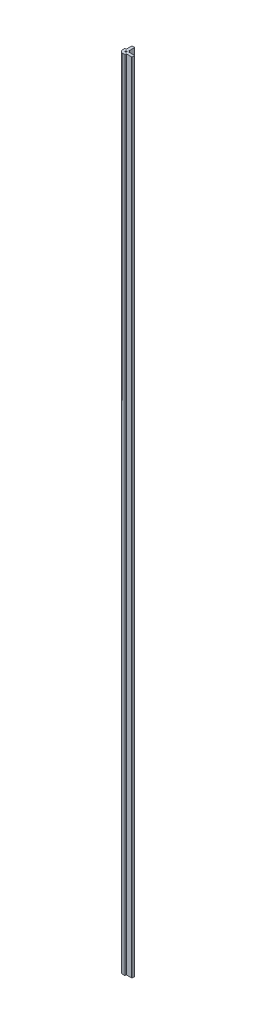
ISO-10303-21;
HEADER;
FILE_DESCRIPTION(('STEP AP214'),'2;1');
FILE_NAME('part.step','',(''),(''),'','','');
FILE_SCHEMA(('AUTOMOTIVE_DESIGN { 1 0 10303 214 1 1 1 1 }'));
ENDSEC;
DATA;
#1=APPLICATION_CONTEXT('core data for automotive mechanical design processes');
#2=APPLICATION_PROTOCOL_DEFINITION('international standard','automotive_design',2000,#1);
#3=PRODUCT_CONTEXT('',#1,'mechanical');
#4=PRODUCT('Part','Part','',(#3));
#5=PRODUCT_RELATED_PRODUCT_CATEGORY('part','',(#4));
#6=PRODUCT_DEFINITION_FORMATION('','',#4);
#7=PRODUCT_DEFINITION_CONTEXT('part definition',#1,'design');
#8=PRODUCT_DEFINITION('design','',#6,#7);
#9=PRODUCT_DEFINITION_SHAPE('','',#8);
#10=(LENGTH_UNIT() NAMED_UNIT(*) SI_UNIT(.MILLI.,.METRE.));
#11=(NAMED_UNIT(*) PLANE_ANGLE_UNIT() SI_UNIT($,.RADIAN.));
#12=(NAMED_UNIT(*) SI_UNIT($,.STERADIAN.) SOLID_ANGLE_UNIT());
#13=UNCERTAINTY_MEASURE_WITH_UNIT(LENGTH_MEASURE(1.E-05),#10,'distance_accuracy_value','');
#14=(GEOMETRIC_REPRESENTATION_CONTEXT(3) GLOBAL_UNCERTAINTY_ASSIGNED_CONTEXT((#13)) GLOBAL_UNIT_ASSIGNED_CONTEXT((#10,
#11,#12)) REPRESENTATION_CONTEXT('',''));
#15=CARTESIAN_POINT('',(0.,0.,0.));
#16=DIRECTION('',(0.,0.,1.));
#17=DIRECTION('',(1.,0.,0.));
#18=AXIS2_PLACEMENT_3D('',#15,#16,#17);
#19=CARTESIAN_POINT('',(1.143,1828.8,-17.018));
#20=DIRECTION('',(0.,-1.,0.));
#21=DIRECTION('',(0.,0.,-1.));
#22=AXIS2_PLACEMENT_3D('',#19,#20,#21);
#23=CYLINDRICAL_SURFACE('',#22,0.762000000000001);
#24=CARTESIAN_POINT('',(1.143,0.,-17.018));
#25=DIRECTION('',(0.,1.,0.));
#26=DIRECTION('',(0.,0.,1.));
#27=AXIS2_PLACEMENT_3D('',#24,#25,#26);
#28=CIRCLE('',#27,0.762000000000001);
#29=CARTESIAN_POINT('',(1.905,0.,-17.018));
#30=VERTEX_POINT('',#29);
#31=CARTESIAN_POINT('',(1.143,0.,-17.78));
#32=VERTEX_POINT('',#31);
#33=EDGE_CURVE('E215',#30,#32,#28,.T.);
#34=ORIENTED_EDGE('',*,*,#33,.T.);
#35=DIRECTION('',(0.,-1.,0.));
#36=VECTOR('',#35,1.);
#37=CARTESIAN_POINT('',(1.143,1828.8,-17.78));
#38=LINE('',#37,#36);
#39=CARTESIAN_POINT('',(1.143,1828.8,-17.78));
#40=VERTEX_POINT('',#39);
#41=EDGE_CURVE('E11',#40,#32,#38,.T.);
#42=ORIENTED_EDGE('',*,*,#41,.F.);
#43=CARTESIAN_POINT('',(1.143,1828.8,-17.018));
#44=DIRECTION('',(0.,1.,0.));
#45=DIRECTION('',(0.,0.,1.));
#46=AXIS2_PLACEMENT_3D('',#43,#44,#45);
#47=CIRCLE('',#46,0.762000000000001);
#48=CARTESIAN_POINT('',(1.905,1828.8,-17.018));
#49=VERTEX_POINT('',#48);
#50=EDGE_CURVE('E258',#49,#40,#47,.T.);
#51=ORIENTED_EDGE('',*,*,#50,.F.);
#52=DIRECTION('',(0.,-1.,0.));
#53=VECTOR('',#52,1.);
#54=CARTESIAN_POINT('',(1.905,1828.8,-17.018));
#55=LINE('',#54,#53);
#56=EDGE_CURVE('E211',#49,#30,#55,.T.);
#57=ORIENTED_EDGE('',*,*,#56,.T.);
#58=EDGE_LOOP('',(#34,#42,#51,#57));
#59=FACE_BOUND('',#58,.T.);
#60=ADVANCED_FACE('F35',(#59),#23,.T.);
#61=CARTESIAN_POINT('',(-3.683,1828.8,-17.78));
#62=DIRECTION('',(0.,0.,1.));
#63=DIRECTION('',(1.,0.,0.));
#64=AXIS2_PLACEMENT_3D('',#61,#62,#63);
#65=PLANE('',#64);
#66=DIRECTION('',(-1.,0.,0.));
#67=VECTOR('',#66,1.);
#68=CARTESIAN_POINT('',(-3.683,0.,-17.78));
#69=LINE('',#68,#67);
#70=CARTESIAN_POINT('',(-3.683,0.,-17.78));
#71=VERTEX_POINT('',#70);
#72=EDGE_CURVE('E218',#32,#71,#69,.T.);
#73=ORIENTED_EDGE('',*,*,#72,.T.);
#74=DIRECTION('',(0.,-1.,0.));
#75=VECTOR('',#74,1.);
#76=CARTESIAN_POINT('',(-3.683,1828.8,-17.78));
#77=LINE('',#76,#75);
#78=CARTESIAN_POINT('',(-3.683,1828.8,-17.78));
#79=VERTEX_POINT('',#78);
#80=EDGE_CURVE('E43',#79,#71,#77,.T.);
#81=ORIENTED_EDGE('',*,*,#80,.F.);
#82=DIRECTION('',(-1.,0.,0.));
#83=VECTOR('',#82,1.);
#84=CARTESIAN_POINT('',(-3.683,1828.8,-17.78));
#85=LINE('',#84,#83);
#86=EDGE_CURVE('E136',#40,#79,#85,.T.);
#87=ORIENTED_EDGE('',*,*,#86,.F.);
#88=ORIENTED_EDGE('',*,*,#41,.T.);
#89=EDGE_LOOP('',(#73,#81,#87,#88));
#90=FACE_BOUND('',#89,.T.);
#91=ADVANCED_FACE('F387',(#90),#65,.F.);
#92=CARTESIAN_POINT('',(-3.683,1828.8,-17.018));
#93=DIRECTION('',(0.,-1.,0.));
#94=DIRECTION('',(0.,0.,-1.));
#95=AXIS2_PLACEMENT_3D('',#92,#93,#94);
#96=CYLINDRICAL_SURFACE('',#95,0.762000000000001);
#97=CARTESIAN_POINT('',(-3.683,0.,-17.018));
#98=DIRECTION('',(0.,1.,0.));
#99=DIRECTION('',(0.,0.,-1.));
#100=AXIS2_PLACEMENT_3D('',#97,#98,#99);
#101=CIRCLE('',#100,0.762000000000001);
#102=CARTESIAN_POINT('',(-4.445,0.,-17.018));
#103=VERTEX_POINT('',#102);
#104=EDGE_CURVE('E221',#71,#103,#101,.T.);
#105=ORIENTED_EDGE('',*,*,#104,.T.);
#106=DIRECTION('',(0.,-1.,0.));
#107=VECTOR('',#106,1.);
#108=CARTESIAN_POINT('',(-4.445,1828.8,-17.018));
#109=LINE('',#108,#107);
#110=CARTESIAN_POINT('',(-4.445,1828.8,-17.018));
#111=VERTEX_POINT('',#110);
#112=EDGE_CURVE('E307',#111,#103,#109,.T.);
#113=ORIENTED_EDGE('',*,*,#112,.F.);
#114=CARTESIAN_POINT('',(-3.683,1828.8,-17.018));
#115=DIRECTION('',(0.,1.,0.));
#116=DIRECTION('',(0.,0.,-1.));
#117=AXIS2_PLACEMENT_3D('',#114,#115,#116);
#118=CIRCLE('',#117,0.762000000000001);
#119=EDGE_CURVE('E315',#79,#111,#118,.T.);
#120=ORIENTED_EDGE('',*,*,#119,.F.);
#121=ORIENTED_EDGE('',*,*,#80,.T.);
#122=EDGE_LOOP('',(#105,#113,#120,#121));
#123=FACE_BOUND('',#122,.T.);
#124=ADVANCED_FACE('F313',(#123),#96,.T.);
#125=CARTESIAN_POINT('',(-4.445,1828.8,-17.018));
#126=DIRECTION('',(1.,0.,0.));
#127=DIRECTION('',(0.,0.,-1.));
#128=AXIS2_PLACEMENT_3D('',#125,#126,#127);
#129=PLANE('',#128);
#130=DIRECTION('',(0.,0.,1.));
#131=VECTOR('',#130,1.);
#132=CARTESIAN_POINT('',(-4.445,0.,-17.018));
#133=LINE('',#132,#131);
#134=CARTESIAN_POINT('',(-4.445,0.,-4.953));
#135=VERTEX_POINT('',#134);
#136=EDGE_CURVE('E223',#103,#135,#133,.T.);
#137=ORIENTED_EDGE('',*,*,#136,.T.);
#138=DIRECTION('',(0.,-1.,0.));
#139=VECTOR('',#138,1.);
#140=CARTESIAN_POINT('',(-4.445,1828.8,-4.953));
#141=LINE('',#140,#139);
#142=CARTESIAN_POINT('',(-4.445,1828.8,-4.953));
#143=VERTEX_POINT('',#142);
#144=EDGE_CURVE('E304',#143,#135,#141,.T.);
#145=ORIENTED_EDGE('',*,*,#144,.F.);
#146=DIRECTION('',(0.,0.,1.));
#147=VECTOR('',#146,1.);
#148=CARTESIAN_POINT('',(-4.445,1828.8,-17.018));
#149=LINE('',#148,#147);
#150=EDGE_CURVE('E333',#111,#143,#149,.T.);
#151=ORIENTED_EDGE('',*,*,#150,.F.);
#152=ORIENTED_EDGE('',*,*,#112,.T.);
#153=EDGE_LOOP('',(#137,#145,#151,#152));
#154=FACE_BOUND('',#153,.T.);
#155=ADVANCED_FACE('F324',(#154),#129,.F.);
#156=CARTESIAN_POINT('',(-4.572,1828.8,-4.953));
#157=DIRECTION('',(0.,-1.,0.));
#158=DIRECTION('',(0.,0.,-1.));
#159=AXIS2_PLACEMENT_3D('',#156,#157,#158);
#160=CYLINDRICAL_SURFACE('',#159,0.127);
#161=CARTESIAN_POINT('',(-4.572,0.,-4.953));
#162=DIRECTION('',(0.,-1.,0.));
#163=DIRECTION('',(0.,0.,-1.));
#164=AXIS2_PLACEMENT_3D('',#161,#162,#163);
#165=CIRCLE('',#164,0.127);
#166=CARTESIAN_POINT('',(-4.572,0.,-4.826));
#167=VERTEX_POINT('',#166);
#168=EDGE_CURVE('E225',#135,#167,#165,.T.);
#169=ORIENTED_EDGE('',*,*,#168,.T.);
#170=DIRECTION('',(0.,-1.,0.));
#171=VECTOR('',#170,1.);
#172=CARTESIAN_POINT('',(-4.572,1828.8,-4.826));
#173=LINE('',#172,#171);
#174=CARTESIAN_POINT('',(-4.572,1828.8,-4.826));
#175=VERTEX_POINT('',#174);
#176=EDGE_CURVE('E301',#175,#167,#173,.T.);
#177=ORIENTED_EDGE('',*,*,#176,.F.);
#178=CARTESIAN_POINT('',(-4.572,1828.8,-4.953));
#179=DIRECTION('',(0.,-1.,0.));
#180=DIRECTION('',(0.,0.,-1.));
#181=AXIS2_PLACEMENT_3D('',#178,#179,#180);
#182=CIRCLE('',#181,0.127);
#183=EDGE_CURVE('E330',#143,#175,#182,.T.);
#184=ORIENTED_EDGE('',*,*,#183,.F.);
#185=ORIENTED_EDGE('',*,*,#144,.T.);
#186=EDGE_LOOP('',(#169,#177,#184,#185));
#187=FACE_BOUND('',#186,.T.);
#188=ADVANCED_FACE('F328',(#187),#160,.F.);
#189=CARTESIAN_POINT('',(-4.572,1828.8,-4.826));
#190=DIRECTION('',(0.,0.,1.));
#191=DIRECTION('',(1.,0.,0.));
#192=AXIS2_PLACEMENT_3D('',#189,#190,#191);
#193=PLANE('',#192);
#194=DIRECTION('',(-1.,0.,0.));
#195=VECTOR('',#194,1.);
#196=CARTESIAN_POINT('',(-4.572,0.,-4.826));
#197=LINE('',#196,#195);
#198=CARTESIAN_POINT('',(-7.366,0.,-4.826));
#199=VERTEX_POINT('',#198);
#200=EDGE_CURVE('E227',#167,#199,#197,.T.);
#201=ORIENTED_EDGE('',*,*,#200,.T.);
#202=DIRECTION('',(0.,-1.,0.));
#203=VECTOR('',#202,1.);
#204=CARTESIAN_POINT('',(-7.366,1828.8,-4.826));
#205=LINE('',#204,#203);
#206=CARTESIAN_POINT('',(-7.366,1828.8,-4.826));
#207=VERTEX_POINT('',#206);
#208=EDGE_CURVE('E298',#207,#199,#205,.T.);
#209=ORIENTED_EDGE('',*,*,#208,.F.);
#210=DIRECTION('',(-1.,0.,0.));
#211=VECTOR('',#210,1.);
#212=CARTESIAN_POINT('',(-4.572,1828.8,-4.826));
#213=LINE('',#212,#211);
#214=EDGE_CURVE('E332',#175,#207,#213,.T.);
#215=ORIENTED_EDGE('',*,*,#214,.F.);
#216=ORIENTED_EDGE('',*,*,#176,.T.);
#217=EDGE_LOOP('',(#201,#209,#215,#216));
#218=FACE_BOUND('',#217,.T.);
#219=ADVANCED_FACE('F400',(#218),#193,.F.);
#220=CARTESIAN_POINT('',(-7.366,1828.8,-4.572));
#221=DIRECTION('',(0.,-1.,0.));
#222=DIRECTION('',(0.,0.,-1.));
#223=AXIS2_PLACEMENT_3D('',#220,#221,#222);
#224=CYLINDRICAL_SURFACE('',#223,0.253999999999999);
#225=CARTESIAN_POINT('',(-7.366,0.,-4.572));
#226=DIRECTION('',(0.,1.,0.));
#227=DIRECTION('',(0.,0.,1.));
#228=AXIS2_PLACEMENT_3D('',#225,#226,#227);
#229=CIRCLE('',#228,0.253999999999999);
#230=CARTESIAN_POINT('',(-7.62,0.,-4.572));
#231=VERTEX_POINT('',#230);
#232=EDGE_CURVE('E229',#199,#231,#229,.T.);
#233=ORIENTED_EDGE('',*,*,#232,.T.);
#234=DIRECTION('',(0.,-1.,0.));
#235=VECTOR('',#234,1.);
#236=CARTESIAN_POINT('',(-7.62,1828.8,-4.572));
#237=LINE('',#236,#235);
#238=CARTESIAN_POINT('',(-7.62,1828.8,-4.572));
#239=VERTEX_POINT('',#238);
#240=EDGE_CURVE('E295',#239,#231,#237,.T.);
#241=ORIENTED_EDGE('',*,*,#240,.F.);
#242=CARTESIAN_POINT('',(-7.366,1828.8,-4.572));
#243=DIRECTION('',(0.,1.,0.));
#244=DIRECTION('',(0.,0.,1.));
#245=AXIS2_PLACEMENT_3D('',#242,#243,#244);
#246=CIRCLE('',#245,0.253999999999999);
#247=EDGE_CURVE('E335',#207,#239,#246,.T.);
#248=ORIENTED_EDGE('',*,*,#247,.F.);
#249=ORIENTED_EDGE('',*,*,#208,.T.);
#250=EDGE_LOOP('',(#233,#241,#248,#249));
#251=FACE_BOUND('',#250,.T.);
#252=ADVANCED_FACE('F403',(#251),#224,.T.);
#253=CARTESIAN_POINT('',(-7.62,1828.8,0.));
#254=DIRECTION('',(1.,0.,0.));
#255=DIRECTION('',(0.,0.,-1.));
#256=AXIS2_PLACEMENT_3D('',#253,#254,#255);
#257=PLANE('',#256);
#258=DIRECTION('',(0.,0.,1.));
#259=VECTOR('',#258,1.);
#260=CARTESIAN_POINT('',(-7.62,0.,0.));
#261=LINE('',#260,#259);
#262=CARTESIAN_POINT('',(-7.62,0.,0.));
#263=VERTEX_POINT('',#262);
#264=EDGE_CURVE('E231',#231,#263,#261,.T.);
#265=ORIENTED_EDGE('',*,*,#264,.T.);
#266=DIRECTION('',(0.,-1.,0.));
#267=VECTOR('',#266,1.);
#268=CARTESIAN_POINT('',(-7.62,1828.8,0.));
#269=LINE('',#268,#267);
#270=CARTESIAN_POINT('',(-7.62,1828.8,0.));
#271=VERTEX_POINT('',#270);
#272=EDGE_CURVE('E292',#271,#263,#269,.T.);
#273=ORIENTED_EDGE('',*,*,#272,.F.);
#274=DIRECTION('',(0.,0.,1.));
#275=VECTOR('',#274,1.);
#276=CARTESIAN_POINT('',(-7.62,1828.8,0.));
#277=LINE('',#276,#275);
#278=EDGE_CURVE('E341',#239,#271,#277,.T.);
#279=ORIENTED_EDGE('',*,*,#278,.F.);
#280=ORIENTED_EDGE('',*,*,#240,.T.);
#281=EDGE_LOOP('',(#265,#273,#279,#280));
#282=FACE_BOUND('',#281,.T.);
#283=ADVANCED_FACE('F407',(#282),#257,.F.);
#284=CARTESIAN_POINT('',(0.,1828.8,0.));
#285=DIRECTION('',(0.,-1.,0.));
#286=DIRECTION('',(0.,0.,-1.));
#287=AXIS2_PLACEMENT_3D('',#284,#285,#286);
#288=CYLINDRICAL_SURFACE('',#287,7.62);
#289=CARTESIAN_POINT('',(0.,0.,0.));
#290=DIRECTION('',(0.,1.,0.));
#291=DIRECTION('',(0.,0.,-1.));
#292=AXIS2_PLACEMENT_3D('',#289,#290,#291);
#293=CIRCLE('',#292,7.62);
#294=CARTESIAN_POINT('',(0.,0.,7.62));
#295=VERTEX_POINT('',#294);
#296=EDGE_CURVE('E233',#263,#295,#293,.T.);
#297=ORIENTED_EDGE('',*,*,#296,.T.);
#298=DIRECTION('',(0.,-1.,0.));
#299=VECTOR('',#298,1.);
#300=CARTESIAN_POINT('',(0.,1828.8,7.62));
#301=LINE('',#300,#299);
#302=CARTESIAN_POINT('',(0.,1828.8,7.62));
#303=VERTEX_POINT('',#302);
#304=EDGE_CURVE('E289',#303,#295,#301,.T.);
#305=ORIENTED_EDGE('',*,*,#304,.F.);
#306=CARTESIAN_POINT('',(0.,1828.8,0.));
#307=DIRECTION('',(0.,1.,0.));
#308=DIRECTION('',(0.,0.,-1.));
#309=AXIS2_PLACEMENT_3D('',#306,#307,#308);
#310=CIRCLE('',#309,7.62);
#311=EDGE_CURVE('E343',#271,#303,#310,.T.);
#312=ORIENTED_EDGE('',*,*,#311,.F.);
#313=ORIENTED_EDGE('',*,*,#272,.T.);
#314=EDGE_LOOP('',(#297,#305,#312,#313));
#315=FACE_BOUND('',#314,.T.);
#316=ADVANCED_FACE('F411',(#315),#288,.T.);
#317=CARTESIAN_POINT('',(0.,1828.8,7.62));
#318=DIRECTION('',(0.,0.,-1.));
#319=DIRECTION('',(-1.,0.,0.));
#320=AXIS2_PLACEMENT_3D('',#317,#318,#319);
#321=PLANE('',#320);
#322=DIRECTION('',(1.,0.,0.));
#323=VECTOR('',#322,1.);
#324=CARTESIAN_POINT('',(0.,0.,7.62));
#325=LINE('',#324,#323);
#326=CARTESIAN_POINT('',(4.572,0.,7.62));
#327=VERTEX_POINT('',#326);
#328=EDGE_CURVE('E235',#295,#327,#325,.T.);
#329=ORIENTED_EDGE('',*,*,#328,.T.);
#330=DIRECTION('',(0.,-1.,0.));
#331=VECTOR('',#330,1.);
#332=CARTESIAN_POINT('',(4.572,1828.8,7.62));
#333=LINE('',#332,#331);
#334=CARTESIAN_POINT('',(4.572,1828.8,7.62));
#335=VERTEX_POINT('',#334);
#336=EDGE_CURVE('E286',#335,#327,#333,.T.);
#337=ORIENTED_EDGE('',*,*,#336,.F.);
#338=DIRECTION('',(1.,0.,0.));
#339=VECTOR('',#338,1.);
#340=CARTESIAN_POINT('',(0.,1828.8,7.62));
#341=LINE('',#340,#339);
#342=EDGE_CURVE('E345',#303,#335,#341,.T.);
#343=ORIENTED_EDGE('',*,*,#342,.F.);
#344=ORIENTED_EDGE('',*,*,#304,.T.);
#345=EDGE_LOOP('',(#329,#337,#343,#344));
#346=FACE_BOUND('',#345,.T.);
#347=ADVANCED_FACE('F415',(#346),#321,.F.);
#348=CARTESIAN_POINT('',(4.572,1828.8,7.366));
#349=DIRECTION('',(0.,-1.,0.));
#350=DIRECTION('',(0.,0.,-1.));
#351=AXIS2_PLACEMENT_3D('',#348,#349,#350);
#352=CYLINDRICAL_SURFACE('',#351,0.253999999999999);
#353=CARTESIAN_POINT('',(4.572,0.,7.366));
#354=DIRECTION('',(0.,1.,0.));
#355=DIRECTION('',(0.,0.,-1.));
#356=AXIS2_PLACEMENT_3D('',#353,#354,#355);
#357=CIRCLE('',#356,0.253999999999999);
#358=CARTESIAN_POINT('',(4.826,0.,7.366));
#359=VERTEX_POINT('',#358);
#360=EDGE_CURVE('E237',#327,#359,#357,.T.);
#361=ORIENTED_EDGE('',*,*,#360,.T.);
#362=DIRECTION('',(0.,-1.,0.));
#363=VECTOR('',#362,1.);
#364=CARTESIAN_POINT('',(4.826,1828.8,7.366));
#365=LINE('',#364,#363);
#366=CARTESIAN_POINT('',(4.826,1828.8,7.366));
#367=VERTEX_POINT('',#366);
#368=EDGE_CURVE('E283',#367,#359,#365,.T.);
#369=ORIENTED_EDGE('',*,*,#368,.F.);
#370=CARTESIAN_POINT('',(4.572,1828.8,7.366));
#371=DIRECTION('',(0.,1.,0.));
#372=DIRECTION('',(0.,0.,-1.));
#373=AXIS2_PLACEMENT_3D('',#370,#371,#372);
#374=CIRCLE('',#373,0.253999999999999);
#375=EDGE_CURVE('E347',#335,#367,#374,.T.);
#376=ORIENTED_EDGE('',*,*,#375,.F.);
#377=ORIENTED_EDGE('',*,*,#336,.T.);
#378=EDGE_LOOP('',(#361,#369,#376,#377));
#379=FACE_BOUND('',#378,.T.);
#380=ADVANCED_FACE('F419',(#379),#352,.T.);
#381=CARTESIAN_POINT('',(4.826,1828.8,4.572));
#382=DIRECTION('',(-1.,0.,0.));
#383=DIRECTION('',(0.,0.,1.));
#384=AXIS2_PLACEMENT_3D('',#381,#382,#383);
#385=PLANE('',#384);
#386=DIRECTION('',(0.,0.,-1.));
#387=VECTOR('',#386,1.);
#388=CARTESIAN_POINT('',(4.826,0.,4.572));
#389=LINE('',#388,#387);
#390=CARTESIAN_POINT('',(4.826,0.,4.572));
#391=VERTEX_POINT('',#390);
#392=EDGE_CURVE('E239',#359,#391,#389,.T.);
#393=ORIENTED_EDGE('',*,*,#392,.T.);
#394=DIRECTION('',(0.,-1.,0.));
#395=VECTOR('',#394,1.);
#396=CARTESIAN_POINT('',(4.826,1828.8,4.572));
#397=LINE('',#396,#395);
#398=CARTESIAN_POINT('',(4.826,1828.8,4.572));
#399=VERTEX_POINT('',#398);
#400=EDGE_CURVE('E280',#399,#391,#397,.T.);
#401=ORIENTED_EDGE('',*,*,#400,.F.);
#402=DIRECTION('',(0.,0.,-1.));
#403=VECTOR('',#402,1.);
#404=CARTESIAN_POINT('',(4.826,1828.8,4.572));
#405=LINE('',#404,#403);
#406=EDGE_CURVE('E349',#367,#399,#405,.T.);
#407=ORIENTED_EDGE('',*,*,#406,.F.);
#408=ORIENTED_EDGE('',*,*,#368,.T.);
#409=EDGE_LOOP('',(#393,#401,#407,#408));
#410=FACE_BOUND('',#409,.T.);
#411=ADVANCED_FACE('F423',(#410),#385,.F.);
#412=CARTESIAN_POINT('',(4.953,1828.8,4.572));
#413=DIRECTION('',(0.,-1.,0.));
#414=DIRECTION('',(0.,0.,-1.));
#415=AXIS2_PLACEMENT_3D('',#412,#413,#414);
#416=CYLINDRICAL_SURFACE('',#415,0.127000000000001);
#417=CARTESIAN_POINT('',(4.953,0.,4.572));
#418=DIRECTION('',(0.,-1.,0.));
#419=DIRECTION('',(0.,0.,1.));
#420=AXIS2_PLACEMENT_3D('',#417,#418,#419);
#421=CIRCLE('',#420,0.127000000000001);
#422=CARTESIAN_POINT('',(4.953,0.,4.445));
#423=VERTEX_POINT('',#422);
#424=EDGE_CURVE('E241',#391,#423,#421,.T.);
#425=ORIENTED_EDGE('',*,*,#424,.T.);
#426=DIRECTION('',(0.,-1.,0.));
#427=VECTOR('',#426,1.);
#428=CARTESIAN_POINT('',(4.953,1828.8,4.445));
#429=LINE('',#428,#427);
#430=CARTESIAN_POINT('',(4.953,1828.8,4.445));
#431=VERTEX_POINT('',#430);
#432=EDGE_CURVE('E277',#431,#423,#429,.T.);
#433=ORIENTED_EDGE('',*,*,#432,.F.);
#434=CARTESIAN_POINT('',(4.953,1828.8,4.572));
#435=DIRECTION('',(0.,-1.,0.));
#436=DIRECTION('',(0.,0.,1.));
#437=AXIS2_PLACEMENT_3D('',#434,#435,#436);
#438=CIRCLE('',#437,0.127000000000001);
#439=EDGE_CURVE('E351',#399,#431,#438,.T.);
#440=ORIENTED_EDGE('',*,*,#439,.F.);
#441=ORIENTED_EDGE('',*,*,#400,.T.);
#442=EDGE_LOOP('',(#425,#433,#440,#441));
#443=FACE_BOUND('',#442,.T.);
#444=ADVANCED_FACE('F427',(#443),#416,.F.);
#445=CARTESIAN_POINT('',(17.018,1828.8,4.445));
#446=DIRECTION('',(0.,0.,-1.));
#447=DIRECTION('',(-1.,0.,0.));
#448=AXIS2_PLACEMENT_3D('',#445,#446,#447);
#449=PLANE('',#448);
#450=DIRECTION('',(1.,0.,0.));
#451=VECTOR('',#450,1.);
#452=CARTESIAN_POINT('',(17.018,0.,4.445));
#453=LINE('',#452,#451);
#454=CARTESIAN_POINT('',(17.018,0.,4.445));
#455=VERTEX_POINT('',#454);
#456=EDGE_CURVE('E243',#423,#455,#453,.T.);
#457=ORIENTED_EDGE('',*,*,#456,.T.);
#458=DIRECTION('',(0.,-1.,0.));
#459=VECTOR('',#458,1.);
#460=CARTESIAN_POINT('',(17.018,1828.8,4.445));
#461=LINE('',#460,#459);
#462=CARTESIAN_POINT('',(17.018,1828.8,4.445));
#463=VERTEX_POINT('',#462);
#464=EDGE_CURVE('E274',#463,#455,#461,.T.);
#465=ORIENTED_EDGE('',*,*,#464,.F.);
#466=DIRECTION('',(1.,0.,0.));
#467=VECTOR('',#466,1.);
#468=CARTESIAN_POINT('',(17.018,1828.8,4.445));
#469=LINE('',#468,#467);
#470=EDGE_CURVE('E353',#431,#463,#469,.T.);
#471=ORIENTED_EDGE('',*,*,#470,.F.);
#472=ORIENTED_EDGE('',*,*,#432,.T.);
#473=EDGE_LOOP('',(#457,#465,#471,#472));
#474=FACE_BOUND('',#473,.T.);
#475=ADVANCED_FACE('F431',(#474),#449,.F.);
#476=CARTESIAN_POINT('',(17.018,1828.8,3.683));
#477=DIRECTION('',(0.,-1.,0.));
#478=DIRECTION('',(0.,0.,-1.));
#479=AXIS2_PLACEMENT_3D('',#476,#477,#478);
#480=CYLINDRICAL_SURFACE('',#479,0.761999999999997);
#481=CARTESIAN_POINT('',(17.018,0.,3.683));
#482=DIRECTION('',(0.,1.,0.));
#483=DIRECTION('',(0.,0.,1.));
#484=AXIS2_PLACEMENT_3D('',#481,#482,#483);
#485=CIRCLE('',#484,0.761999999999997);
#486=CARTESIAN_POINT('',(17.78,0.,3.683));
#487=VERTEX_POINT('',#486);
#488=EDGE_CURVE('E245',#455,#487,#485,.T.);
#489=ORIENTED_EDGE('',*,*,#488,.T.);
#490=DIRECTION('',(0.,-1.,0.));
#491=VECTOR('',#490,1.);
#492=CARTESIAN_POINT('',(17.78,1828.8,3.683));
#493=LINE('',#492,#491);
#494=CARTESIAN_POINT('',(17.78,1828.8,3.683));
#495=VERTEX_POINT('',#494);
#496=EDGE_CURVE('E271',#495,#487,#493,.T.);
#497=ORIENTED_EDGE('',*,*,#496,.F.);
#498=CARTESIAN_POINT('',(17.018,1828.8,3.683));
#499=DIRECTION('',(0.,1.,0.));
#500=DIRECTION('',(0.,0.,1.));
#501=AXIS2_PLACEMENT_3D('',#498,#499,#500);
#502=CIRCLE('',#501,0.761999999999997);
#503=EDGE_CURVE('E355',#463,#495,#502,.T.);
#504=ORIENTED_EDGE('',*,*,#503,.F.);
#505=ORIENTED_EDGE('',*,*,#464,.T.);
#506=EDGE_LOOP('',(#489,#497,#504,#505));
#507=FACE_BOUND('',#506,.T.);
#508=ADVANCED_FACE('F435',(#507),#480,.T.);
#509=CARTESIAN_POINT('',(17.78,1828.8,3.683));
#510=DIRECTION('',(-1.,0.,0.));
#511=DIRECTION('',(0.,0.,1.));
#512=AXIS2_PLACEMENT_3D('',#509,#510,#511);
#513=PLANE('',#512);
#514=DIRECTION('',(0.,0.,-1.));
#515=VECTOR('',#514,1.);
#516=CARTESIAN_POINT('',(17.78,0.,3.683));
#517=LINE('',#516,#515);
#518=CARTESIAN_POINT('',(17.78,0.,-1.143));
#519=VERTEX_POINT('',#518);
#520=EDGE_CURVE('E247',#487,#519,#517,.T.);
#521=ORIENTED_EDGE('',*,*,#520,.T.);
#522=DIRECTION('',(0.,-1.,0.));
#523=VECTOR('',#522,1.);
#524=CARTESIAN_POINT('',(17.78,1828.8,-1.143));
#525=LINE('',#524,#523);
#526=CARTESIAN_POINT('',(17.78,1828.8,-1.143));
#527=VERTEX_POINT('',#526);
#528=EDGE_CURVE('E268',#527,#519,#525,.T.);
#529=ORIENTED_EDGE('',*,*,#528,.F.);
#530=DIRECTION('',(0.,0.,-1.));
#531=VECTOR('',#530,1.);
#532=CARTESIAN_POINT('',(17.78,1828.8,3.683));
#533=LINE('',#532,#531);
#534=EDGE_CURVE('E357',#495,#527,#533,.T.);
#535=ORIENTED_EDGE('',*,*,#534,.F.);
#536=ORIENTED_EDGE('',*,*,#496,.T.);
#537=EDGE_LOOP('',(#521,#529,#535,#536));
#538=FACE_BOUND('',#537,.T.);
#539=ADVANCED_FACE('F439',(#538),#513,.F.);
#540=CARTESIAN_POINT('',(17.018,1828.8,-1.143));
#541=DIRECTION('',(0.,-1.,0.));
#542=DIRECTION('',(0.,0.,-1.));
#543=AXIS2_PLACEMENT_3D('',#540,#541,#542);
#544=CYLINDRICAL_SURFACE('',#543,0.761999999999996);
#545=CARTESIAN_POINT('',(17.018,0.,-1.143));
#546=DIRECTION('',(0.,1.,0.));
#547=DIRECTION('',(0.,0.,-1.));
#548=AXIS2_PLACEMENT_3D('',#545,#546,#547);
#549=CIRCLE('',#548,0.761999999999996);
#550=CARTESIAN_POINT('',(17.018,0.,-1.905));
#551=VERTEX_POINT('',#550);
#552=EDGE_CURVE('E249',#519,#551,#549,.T.);
#553=ORIENTED_EDGE('',*,*,#552,.T.);
#554=DIRECTION('',(0.,-1.,0.));
#555=VECTOR('',#554,1.);
#556=CARTESIAN_POINT('',(17.018,1828.8,-1.905));
#557=LINE('',#556,#555);
#558=CARTESIAN_POINT('',(17.018,1828.8,-1.905));
#559=VERTEX_POINT('',#558);
#560=EDGE_CURVE('E265',#559,#551,#557,.T.);
#561=ORIENTED_EDGE('',*,*,#560,.F.);
#562=CARTESIAN_POINT('',(17.018,1828.8,-1.143));
#563=DIRECTION('',(0.,1.,0.));
#564=DIRECTION('',(0.,0.,-1.));
#565=AXIS2_PLACEMENT_3D('',#562,#563,#564);
#566=CIRCLE('',#565,0.761999999999996);
#567=EDGE_CURVE('E359',#527,#559,#566,.T.);
#568=ORIENTED_EDGE('',*,*,#567,.F.);
#569=ORIENTED_EDGE('',*,*,#528,.T.);
#570=EDGE_LOOP('',(#553,#561,#568,#569));
#571=FACE_BOUND('',#570,.T.);
#572=ADVANCED_FACE('F443',(#571),#544,.T.);
#573=CARTESIAN_POINT('',(4.87752754989657,1828.8,-1.905));
#574=DIRECTION('',(0.,0.,1.));
#575=DIRECTION('',(1.,0.,0.));
#576=AXIS2_PLACEMENT_3D('',#573,#574,#575);
#577=PLANE('',#576);
#578=DIRECTION('',(-1.,0.,0.));
#579=VECTOR('',#578,1.);
#580=CARTESIAN_POINT('',(4.87752754989657,0.,-1.905));
#581=LINE('',#580,#579);
#582=CARTESIAN_POINT('',(4.87752754989656,0.,-1.905));
#583=VERTEX_POINT('',#582);
#584=EDGE_CURVE('E251',#551,#583,#581,.T.);
#585=ORIENTED_EDGE('',*,*,#584,.T.);
#586=DIRECTION('',(0.,-1.,0.));
#587=VECTOR('',#586,1.);
#588=CARTESIAN_POINT('',(4.87752754989656,1828.8,-1.905));
#589=LINE('',#588,#587);
#590=CARTESIAN_POINT('',(4.87752754989656,1828.8,-1.905));
#591=VERTEX_POINT('',#590);
#592=EDGE_CURVE('E262',#591,#583,#589,.T.);
#593=ORIENTED_EDGE('',*,*,#592,.F.);
#594=DIRECTION('',(-1.,0.,0.));
#595=VECTOR('',#594,1.);
#596=CARTESIAN_POINT('',(4.87752754989657,1828.8,-1.905));
#597=LINE('',#596,#595);
#598=EDGE_CURVE('E361',#559,#591,#597,.T.);
#599=ORIENTED_EDGE('',*,*,#598,.F.);
#600=ORIENTED_EDGE('',*,*,#560,.T.);
#601=EDGE_LOOP('',(#585,#593,#599,#600));
#602=FACE_BOUND('',#601,.T.);
#603=ADVANCED_FACE('F367',(#602),#577,.F.);
#604=CARTESIAN_POINT('',(4.87752754989656,1828.8,-2.159));
#605=DIRECTION('',(0.,-1.,0.));
#606=DIRECTION('',(0.,0.,-1.));
#607=AXIS2_PLACEMENT_3D('',#604,#605,#606);
#608=CYLINDRICAL_SURFACE('',#607,0.254);
#609=CARTESIAN_POINT('',(4.87752754989656,0.,-2.159));
#610=DIRECTION('',(0.,-1.,0.));
#611=DIRECTION('',(0.,0.,1.));
#612=AXIS2_PLACEMENT_3D('',#609,#610,#611);
#613=CIRCLE('',#612,0.254);
#614=CARTESIAN_POINT('',(4.64526433323482,0.,-2.05619047619048));
#615=VERTEX_POINT('',#614);
#616=EDGE_CURVE('E253',#583,#615,#613,.T.);
#617=ORIENTED_EDGE('',*,*,#616,.T.);
#618=DIRECTION('',(0.,-1.,0.));
#619=VECTOR('',#618,1.);
#620=CARTESIAN_POINT('',(4.64526433323482,1828.8,-2.05619047619048));
#621=LINE('',#620,#619);
#622=CARTESIAN_POINT('',(4.64526433323482,1828.8,-2.05619047619048));
#623=VERTEX_POINT('',#622);
#624=EDGE_CURVE('E206',#623,#615,#621,.T.);
#625=ORIENTED_EDGE('',*,*,#624,.F.);
#626=CARTESIAN_POINT('',(4.87752754989656,1828.8,-2.159));
#627=DIRECTION('',(0.,-1.,0.));
#628=DIRECTION('',(0.,0.,1.));
#629=AXIS2_PLACEMENT_3D('',#626,#627,#628);
#630=CIRCLE('',#629,0.254);
#631=EDGE_CURVE('E197',#591,#623,#630,.T.);
#632=ORIENTED_EDGE('',*,*,#631,.F.);
#633=ORIENTED_EDGE('',*,*,#592,.T.);
#634=EDGE_LOOP('',(#617,#625,#632,#633));
#635=FACE_BOUND('',#634,.T.);
#636=ADVANCED_FACE('F371',(#635),#608,.F.);
#637=CARTESIAN_POINT('',(0.,1828.8,0.));
#638=DIRECTION('',(0.,-1.,0.));
#639=DIRECTION('',(0.,0.,-1.));
#640=AXIS2_PLACEMENT_3D('',#637,#638,#639);
#641=CYLINDRICAL_SURFACE('',#640,5.08);
#642=CARTESIAN_POINT('',(0.,0.,0.));
#643=DIRECTION('',(0.,1.,0.));
#644=DIRECTION('',(0.,0.,1.));
#645=AXIS2_PLACEMENT_3D('',#642,#643,#644);
#646=CIRCLE('',#645,5.08);
#647=CARTESIAN_POINT('',(2.05619047619048,0.,-4.64526433323482));
#648=VERTEX_POINT('',#647);
#649=EDGE_CURVE('E205',#615,#648,#646,.T.);
#650=ORIENTED_EDGE('',*,*,#649,.T.);
#651=DIRECTION('',(0.,-1.,0.));
#652=VECTOR('',#651,1.);
#653=CARTESIAN_POINT('',(2.05619047619048,1828.8,-4.64526433323482));
#654=LINE('',#653,#652);
#655=CARTESIAN_POINT('',(2.05619047619048,1828.8,-4.64526433323482));
#656=VERTEX_POINT('',#655);
#657=EDGE_CURVE('E202',#656,#648,#654,.T.);
#658=ORIENTED_EDGE('',*,*,#657,.F.);
#659=CARTESIAN_POINT('',(0.,1828.8,0.));
#660=DIRECTION('',(0.,1.,0.));
#661=DIRECTION('',(0.,0.,1.));
#662=AXIS2_PLACEMENT_3D('',#659,#660,#661);
#663=CIRCLE('',#662,5.08);
#664=EDGE_CURVE('E191',#623,#656,#663,.T.);
#665=ORIENTED_EDGE('',*,*,#664,.F.);
#666=ORIENTED_EDGE('',*,*,#624,.T.);
#667=EDGE_LOOP('',(#650,#658,#665,#666));
#668=FACE_BOUND('',#667,.T.);
#669=ADVANCED_FACE('F203',(#668),#641,.T.);
#670=CARTESIAN_POINT('',(2.159,1828.8,-4.87752754989657));
#671=DIRECTION('',(0.,-1.,0.));
#672=DIRECTION('',(0.,0.,-1.));
#673=AXIS2_PLACEMENT_3D('',#670,#671,#672);
#674=CYLINDRICAL_SURFACE('',#673,0.254);
#675=CARTESIAN_POINT('',(2.159,0.,-4.87752754989657));
#676=DIRECTION('',(0.,-1.,0.));
#677=DIRECTION('',(0.,0.,-1.));
#678=AXIS2_PLACEMENT_3D('',#675,#676,#677);
#679=CIRCLE('',#678,0.254);
#680=CARTESIAN_POINT('',(1.905,0.,-4.87752754989657));
#681=VERTEX_POINT('',#680);
#682=EDGE_CURVE('E122',#648,#681,#679,.T.);
#683=ORIENTED_EDGE('',*,*,#682,.T.);
#684=DIRECTION('',(0.,-1.,0.));
#685=VECTOR('',#684,1.);
#686=CARTESIAN_POINT('',(1.905,1828.8,-4.87752754989657));
#687=LINE('',#686,#685);
#688=CARTESIAN_POINT('',(1.905,1828.8,-4.87752754989657));
#689=VERTEX_POINT('',#688);
#690=EDGE_CURVE('E207',#689,#681,#687,.T.);
#691=ORIENTED_EDGE('',*,*,#690,.F.);
#692=CARTESIAN_POINT('',(2.159,1828.8,-4.87752754989657));
#693=DIRECTION('',(0.,-1.,0.));
#694=DIRECTION('',(0.,0.,-1.));
#695=AXIS2_PLACEMENT_3D('',#692,#693,#694);
#696=CIRCLE('',#695,0.254);
#697=EDGE_CURVE('E195',#656,#689,#696,.T.);
#698=ORIENTED_EDGE('',*,*,#697,.F.);
#699=ORIENTED_EDGE('',*,*,#657,.T.);
#700=EDGE_LOOP('',(#683,#691,#698,#699));
#701=FACE_BOUND('',#700,.T.);
#702=ADVANCED_FACE('F209',(#701),#674,.F.);
#703=CARTESIAN_POINT('',(1.905,1828.8,-17.018));
#704=DIRECTION('',(-1.,0.,0.));
#705=DIRECTION('',(0.,0.,1.));
#706=AXIS2_PLACEMENT_3D('',#703,#704,#705);
#707=PLANE('',#706);
#708=DIRECTION('',(0.,0.,-1.));
#709=VECTOR('',#708,1.);
#710=CARTESIAN_POINT('',(1.905,0.,-17.018));
#711=LINE('',#710,#709);
#712=EDGE_CURVE('E128',#681,#30,#711,.T.);
#713=ORIENTED_EDGE('',*,*,#712,.T.);
#714=ORIENTED_EDGE('',*,*,#56,.F.);
#715=DIRECTION('',(0.,0.,-1.));
#716=VECTOR('',#715,1.);
#717=CARTESIAN_POINT('',(1.905,1828.8,-17.018));
#718=LINE('',#717,#716);
#719=EDGE_CURVE('E51',#689,#49,#718,.T.);
#720=ORIENTED_EDGE('',*,*,#719,.F.);
#721=ORIENTED_EDGE('',*,*,#690,.T.);
#722=EDGE_LOOP('',(#713,#714,#720,#721));
#723=FACE_BOUND('',#722,.T.);
#724=ADVANCED_FACE('F375',(#723),#707,.F.);
#725=CARTESIAN_POINT('',(1.143,1828.8,-17.018));
#726=DIRECTION('',(0.,1.,0.));
#727=DIRECTION('',(0.,0.,1.));
#728=AXIS2_PLACEMENT_3D('',#725,#726,#727);
#729=PLANE('',#728);
#730=CARTESIAN_POINT('',(0.,1828.8,0.));
#731=DIRECTION('',(0.,1.,0.));
#732=DIRECTION('',(0.,0.,1.));
#733=AXIS2_PLACEMENT_3D('',#730,#731,#732);
#734=CIRCLE('',#733,1.72719999999977);
#735=CARTESIAN_POINT('',(0.,1828.8,1.72719999999977));
#736=VERTEX_POINT('',#735);
#737=EDGE_CURVE('E498',#736,#736,#734,.T.);
#738=ORIENTED_EDGE('',*,*,#737,.F.);
#739=EDGE_LOOP('',(#738));
#740=FACE_BOUND('',#739,.T.);
#741=ORIENTED_EDGE('',*,*,#50,.T.);
#742=ORIENTED_EDGE('',*,*,#86,.T.);
#743=ORIENTED_EDGE('',*,*,#119,.T.);
#744=ORIENTED_EDGE('',*,*,#150,.T.);
#745=ORIENTED_EDGE('',*,*,#183,.T.);
#746=ORIENTED_EDGE('',*,*,#214,.T.);
#747=ORIENTED_EDGE('',*,*,#247,.T.);
#748=ORIENTED_EDGE('',*,*,#278,.T.);
#749=ORIENTED_EDGE('',*,*,#311,.T.);
#750=ORIENTED_EDGE('',*,*,#342,.T.);
#751=ORIENTED_EDGE('',*,*,#375,.T.);
#752=ORIENTED_EDGE('',*,*,#406,.T.);
#753=ORIENTED_EDGE('',*,*,#439,.T.);
#754=ORIENTED_EDGE('',*,*,#470,.T.);
#755=ORIENTED_EDGE('',*,*,#503,.T.);
#756=ORIENTED_EDGE('',*,*,#534,.T.);
#757=ORIENTED_EDGE('',*,*,#567,.T.);
#758=ORIENTED_EDGE('',*,*,#598,.T.);
#759=ORIENTED_EDGE('',*,*,#631,.T.);
#760=ORIENTED_EDGE('',*,*,#664,.T.);
#761=ORIENTED_EDGE('',*,*,#697,.T.);
#762=ORIENTED_EDGE('',*,*,#719,.T.);
#763=EDGE_LOOP('',(#741,#742,#743,#744,#745,#746,#747,#748,#749,#750,#751,#752,#753,#754,#755,
#756,#757,#758,#759,#760,#761,#762));
#764=FACE_BOUND('',#763,.T.);
#765=ADVANCED_FACE('F193',(#740,#764),#729,.T.);
#766=CARTESIAN_POINT('',(1.143,0.,-17.018));
#767=DIRECTION('',(0.,1.,0.));
#768=DIRECTION('',(0.,0.,1.));
#769=AXIS2_PLACEMENT_3D('',#766,#767,#768);
#770=PLANE('',#769);
#771=CARTESIAN_POINT('',(0.,0.,0.));
#772=DIRECTION('',(0.,1.,0.));
#773=DIRECTION('',(0.,0.,1.));
#774=AXIS2_PLACEMENT_3D('',#771,#772,#773);
#775=CIRCLE('',#774,1.72719999999955);
#776=CARTESIAN_POINT('',(0.,0.,1.72719999999955));
#777=VERTEX_POINT('',#776);
#778=EDGE_CURVE('E219',#777,#777,#775,.T.);
#779=ORIENTED_EDGE('',*,*,#778,.T.);
#780=EDGE_LOOP('',(#779));
#781=FACE_BOUND('',#780,.T.);
#782=ORIENTED_EDGE('',*,*,#33,.F.);
#783=ORIENTED_EDGE('',*,*,#712,.F.);
#784=ORIENTED_EDGE('',*,*,#682,.F.);
#785=ORIENTED_EDGE('',*,*,#649,.F.);
#786=ORIENTED_EDGE('',*,*,#616,.F.);
#787=ORIENTED_EDGE('',*,*,#584,.F.);
#788=ORIENTED_EDGE('',*,*,#552,.F.);
#789=ORIENTED_EDGE('',*,*,#520,.F.);
#790=ORIENTED_EDGE('',*,*,#488,.F.);
#791=ORIENTED_EDGE('',*,*,#456,.F.);
#792=ORIENTED_EDGE('',*,*,#424,.F.);
#793=ORIENTED_EDGE('',*,*,#392,.F.);
#794=ORIENTED_EDGE('',*,*,#360,.F.);
#795=ORIENTED_EDGE('',*,*,#328,.F.);
#796=ORIENTED_EDGE('',*,*,#296,.F.);
#797=ORIENTED_EDGE('',*,*,#264,.F.);
#798=ORIENTED_EDGE('',*,*,#232,.F.);
#799=ORIENTED_EDGE('',*,*,#200,.F.);
#800=ORIENTED_EDGE('',*,*,#168,.F.);
#801=ORIENTED_EDGE('',*,*,#136,.F.);
#802=ORIENTED_EDGE('',*,*,#104,.F.);
#803=ORIENTED_EDGE('',*,*,#72,.F.);
#804=EDGE_LOOP('',(#782,#783,#784,#785,#786,#787,#788,#789,#790,#791,#792,#793,#794,#795,#796,
#797,#798,#799,#800,#801,#802,#803));
#805=FACE_BOUND('',#804,.T.);
#806=ADVANCED_FACE('F319',(#781,#805),#770,.F.);
#807=CARTESIAN_POINT('',(0.,1828.8,0.));
#808=DIRECTION('',(0.,1.,0.));
#809=DIRECTION('',(0.,0.,1.));
#810=AXIS2_PLACEMENT_3D('',#807,#808,#809);
#811=CYLINDRICAL_SURFACE('',#810,1.72719999999966);
#812=ORIENTED_EDGE('',*,*,#778,.F.);
#813=EDGE_LOOP('',(#812));
#814=FACE_BOUND('',#813,.T.);
#815=ORIENTED_EDGE('',*,*,#737,.T.);
#816=EDGE_LOOP('',(#815));
#817=FACE_BOUND('',#816,.T.);
#818=ADVANCED_FACE('F480',(#814,#817),#811,.F.);
#819=CLOSED_SHELL('',(#60,#91,#124,#155,#188,#219,#252,#283,#316,#347,#380,#411,#444,#475,#508,
#539,#572,#603,#636,#669,#702,#724,#765,#806,#818));
#820=MANIFOLD_SOLID_BREP('B2',#819);
#821=ADVANCED_BREP_SHAPE_REPRESENTATION('',(#18,#820),#14);
#822=SHAPE_DEFINITION_REPRESENTATION(#9,#821);
ENDSEC;
END-ISO-10303-21;
